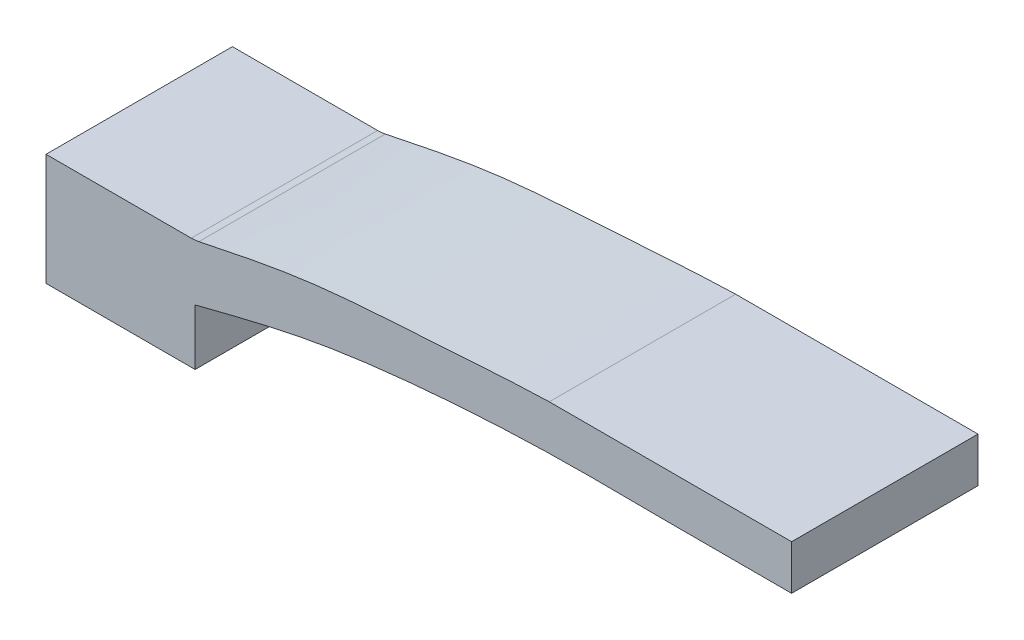
ISO-10303-21;
HEADER;
FILE_DESCRIPTION(('STEP AP214'),'2;1');
FILE_NAME('part.step','',(''),(''),'','','');
FILE_SCHEMA(('AUTOMOTIVE_DESIGN { 1 0 10303 214 1 1 1 1 }'));
ENDSEC;
DATA;
#1=APPLICATION_CONTEXT('core data for automotive mechanical design processes');
#2=APPLICATION_PROTOCOL_DEFINITION('international standard','automotive_design',2000,#1);
#3=PRODUCT_CONTEXT('',#1,'mechanical');
#4=PRODUCT('Part','Part','',(#3));
#5=PRODUCT_RELATED_PRODUCT_CATEGORY('part','',(#4));
#6=PRODUCT_DEFINITION_FORMATION('','',#4);
#7=PRODUCT_DEFINITION_CONTEXT('part definition',#1,'design');
#8=PRODUCT_DEFINITION('design','',#6,#7);
#9=PRODUCT_DEFINITION_SHAPE('','',#8);
#10=(LENGTH_UNIT() NAMED_UNIT(*) SI_UNIT(.MILLI.,.METRE.));
#11=(NAMED_UNIT(*) PLANE_ANGLE_UNIT() SI_UNIT($,.RADIAN.));
#12=(NAMED_UNIT(*) SI_UNIT($,.STERADIAN.) SOLID_ANGLE_UNIT());
#13=UNCERTAINTY_MEASURE_WITH_UNIT(LENGTH_MEASURE(1.E-05),#10,'distance_accuracy_value','');
#14=(GEOMETRIC_REPRESENTATION_CONTEXT(3) GLOBAL_UNCERTAINTY_ASSIGNED_CONTEXT((#13)) GLOBAL_UNIT_ASSIGNED_CONTEXT((#10,
#11,#12)) REPRESENTATION_CONTEXT('',''));
#15=CARTESIAN_POINT('',(0.,0.,0.));
#16=DIRECTION('',(0.,0.,1.));
#17=DIRECTION('',(1.,0.,0.));
#18=AXIS2_PLACEMENT_3D('',#15,#16,#17);
#19=CARTESIAN_POINT('',(0.,40.,0.));
#20=DIRECTION('',(1.,0.,0.));
#21=DIRECTION('',(0.,0.,-1.));
#22=AXIS2_PLACEMENT_3D('',#19,#20,#21);
#23=PLANE('',#22);
#24=DIRECTION('',(0.,0.,1.));
#25=VECTOR('',#24,1.);
#26=CARTESIAN_POINT('',(0.,30.,-50.));
#27=LINE('',#26,#25);
#28=CARTESIAN_POINT('',(0.,30.,-50.));
#29=VERTEX_POINT('',#28);
#30=CARTESIAN_POINT('',(0.,30.,0.));
#31=VERTEX_POINT('',#30);
#32=EDGE_CURVE('E133',#29,#31,#27,.T.);
#33=ORIENTED_EDGE('',*,*,#32,.F.);
#34=DIRECTION('',(0.,-1.,0.));
#35=VECTOR('',#34,1.);
#36=CARTESIAN_POINT('',(0.,40.,-50.));
#37=LINE('',#36,#35);
#38=CARTESIAN_POINT('',(0.,0.,-50.));
#39=VERTEX_POINT('',#38);
#40=EDGE_CURVE('E140',#29,#39,#37,.T.);
#41=ORIENTED_EDGE('',*,*,#40,.T.);
#42=DIRECTION('',(0.,0.,1.));
#43=VECTOR('',#42,1.);
#44=CARTESIAN_POINT('',(0.,0.,0.));
#45=LINE('',#44,#43);
#46=CARTESIAN_POINT('',(0.,0.,0.));
#47=VERTEX_POINT('',#46);
#48=EDGE_CURVE('E150',#39,#47,#45,.T.);
#49=ORIENTED_EDGE('',*,*,#48,.T.);
#50=DIRECTION('',(0.,-1.,0.));
#51=VECTOR('',#50,1.);
#52=CARTESIAN_POINT('',(0.,40.,0.));
#53=LINE('',#52,#51);
#54=EDGE_CURVE('E169',#31,#47,#53,.T.);
#55=ORIENTED_EDGE('',*,*,#54,.F.);
#56=EDGE_LOOP('',(#33,#41,#49,#55));
#57=FACE_BOUND('',#56,.T.);
#58=ADVANCED_FACE('F43',(#57),#23,.F.);
#59=CARTESIAN_POINT('',(0.,40.,0.));
#60=DIRECTION('',(0.,0.,-1.));
#61=DIRECTION('',(-1.,0.,0.));
#62=AXIS2_PLACEMENT_3D('',#59,#60,#61);
#63=PLANE('',#62);
#64=CARTESIAN_POINT('',(40.,30.,0.));
#65=CARTESIAN_POINT('',(49.9656857193114,32.0906070488281,0.));
#66=CARTESIAN_POINT('',(69.7676621871153,36.2446765981113,0.));
#67=CARTESIAN_POINT('',(101.665880924832,37.9916239881097,0.));
#68=CARTESIAN_POINT('',(134.961893861511,40.5324928061145,0.));
#69=CARTESIAN_POINT('',(158.326978774384,40.177401135886,0.));
#70=CARTESIAN_POINT('',(170.,40.,0.));
#71=B_SPLINE_CURVE_WITH_KNOTS('',3,(#64,#65,#66,#67,#68,#69,#70),.UNSPECIFIED.,.F.,.F.,(4,1,1,1,
4),(0.,0.233428342717391,0.463825839947079,0.732131409996437,1.),.UNSPECIFIED.);
#72=CARTESIAN_POINT('',(41.0147935743513,30.2128529286531,0.));
#73=VERTEX_POINT('',#72);
#74=CARTESIAN_POINT('',(135.,40.,0.));
#75=VERTEX_POINT('',#74);
#76=EDGE_CURVE('E129',#73,#75,#71,.T.);
#77=ORIENTED_EDGE('',*,*,#76,.F.);
#78=CARTESIAN_POINT('',(38.9625381799556,40.,0.));
#79=DIRECTION('',(0.,0.,-1.));
#80=DIRECTION('',(-1.,0.,0.));
#81=AXIS2_PLACEMENT_3D('',#78,#79,#80);
#82=CIRCLE('',#81,10.);
#83=CARTESIAN_POINT('',(38.9625381799556,30.,0.));
#84=VERTEX_POINT('',#83);
#85=EDGE_CURVE('E52',#73,#84,#82,.T.);
#86=ORIENTED_EDGE('',*,*,#85,.T.);
#87=DIRECTION('',(-1.,0.,0.));
#88=VECTOR('',#87,1.);
#89=CARTESIAN_POINT('',(0.,30.,0.));
#90=LINE('',#89,#88);
#91=EDGE_CURVE('E181',#84,#31,#90,.T.);
#92=ORIENTED_EDGE('',*,*,#91,.T.);
#93=ORIENTED_EDGE('',*,*,#54,.T.);
#94=DIRECTION('',(1.,0.,0.));
#95=VECTOR('',#94,1.);
#96=CARTESIAN_POINT('',(0.,0.,0.));
#97=LINE('',#96,#95);
#98=CARTESIAN_POINT('',(40.,0.,0.));
#99=VERTEX_POINT('',#98);
#100=EDGE_CURVE('E154',#47,#99,#97,.T.);
#101=ORIENTED_EDGE('',*,*,#100,.T.);
#102=DIRECTION('',(0.,-1.,0.));
#103=VECTOR('',#102,1.);
#104=CARTESIAN_POINT('',(40.,15.,0.));
#105=LINE('',#104,#103);
#106=CARTESIAN_POINT('',(40.,15.,0.));
#107=VERTEX_POINT('',#106);
#108=EDGE_CURVE('E205',#107,#99,#105,.T.);
#109=ORIENTED_EDGE('',*,*,#108,.F.);
#110=CARTESIAN_POINT('',(200.,28.,0.));
#111=CARTESIAN_POINT('',(190.000549699636,27.9716481516772,0.));
#112=CARTESIAN_POINT('',(168.335074048846,27.9102191469779,0.));
#113=CARTESIAN_POINT('',(134.972625039488,28.4302998101888,0.));
#114=CARTESIAN_POINT('',(101.569485276163,26.4846630854096,0.));
#115=CARTESIAN_POINT('',(69.6952259316316,22.6188630793739,0.));
#116=CARTESIAN_POINT('',(49.9566235564014,17.5545571461131,0.));
#117=CARTESIAN_POINT('',(40.,15.,0.));
#118=B_SPLINE_CURVE_WITH_KNOTS('',3,(#110,#111,#112,#113,#114,#115,#116,#117),.UNSPECIFIED.,.F.,
.F.,(4,1,1,1,1,4),(0.,0.186186880037556,0.403404906748039,0.620977286103071,0.808811869763734,
1.),.UNSPECIFIED.);
#119=CARTESIAN_POINT('',(200.,28.,0.));
#120=VERTEX_POINT('',#119);
#121=EDGE_CURVE('E195',#120,#107,#118,.T.);
#122=ORIENTED_EDGE('',*,*,#121,.F.);
#123=DIRECTION('',(0.,-1.,0.));
#124=VECTOR('',#123,1.);
#125=CARTESIAN_POINT('',(200.,40.,0.));
#126=LINE('',#125,#124);
#127=CARTESIAN_POINT('',(200.,40.,0.));
#128=VERTEX_POINT('',#127);
#129=EDGE_CURVE('E165',#128,#120,#126,.T.);
#130=ORIENTED_EDGE('',*,*,#129,.F.);
#131=DIRECTION('',(1.,0.,0.));
#132=VECTOR('',#131,1.);
#133=CARTESIAN_POINT('',(0.,40.,0.));
#134=LINE('',#133,#132);
#135=EDGE_CURVE('E146',#75,#128,#134,.T.);
#136=ORIENTED_EDGE('',*,*,#135,.F.);
#137=EDGE_LOOP('',(#77,#86,#92,#93,#101,#109,#122,#130,#136));
#138=FACE_BOUND('',#137,.T.);
#139=ADVANCED_FACE('F178',(#138),#63,.F.);
#140=CARTESIAN_POINT('',(0.,40.,-50.));
#141=DIRECTION('',(0.,0.,1.));
#142=DIRECTION('',(1.,0.,0.));
#143=AXIS2_PLACEMENT_3D('',#140,#141,#142);
#144=PLANE('',#143);
#145=DIRECTION('',(-1.,0.,0.));
#146=VECTOR('',#145,1.);
#147=CARTESIAN_POINT('',(0.,30.,-50.));
#148=LINE('',#147,#146);
#149=CARTESIAN_POINT('',(38.9625381799556,30.,-50.));
#150=VERTEX_POINT('',#149);
#151=EDGE_CURVE('E125',#150,#29,#148,.T.);
#152=ORIENTED_EDGE('',*,*,#151,.F.);
#153=CARTESIAN_POINT('',(38.9625381799556,40.,-50.));
#154=DIRECTION('',(0.,0.,1.));
#155=DIRECTION('',(1.,0.,0.));
#156=AXIS2_PLACEMENT_3D('',#153,#154,#155);
#157=CIRCLE('',#156,10.);
#158=CARTESIAN_POINT('',(41.0147935743513,30.2128529286531,-50.));
#159=VERTEX_POINT('',#158);
#160=EDGE_CURVE('E11',#150,#159,#157,.T.);
#161=ORIENTED_EDGE('',*,*,#160,.T.);
#162=CARTESIAN_POINT('',(40.,30.,-50.));
#163=CARTESIAN_POINT('',(49.9656857193114,32.0906070488281,-50.));
#164=CARTESIAN_POINT('',(69.7676621871153,36.2446765981113,-50.));
#165=CARTESIAN_POINT('',(101.665880924832,37.9916239881097,-50.));
#166=CARTESIAN_POINT('',(134.961893861511,40.5324928061145,-50.));
#167=CARTESIAN_POINT('',(158.326978774384,40.177401135886,-50.));
#168=CARTESIAN_POINT('',(170.,40.,-50.));
#169=B_SPLINE_CURVE_WITH_KNOTS('',3,(#162,#163,#164,#165,#166,#167,#168),.UNSPECIFIED.,.F.,.F.,
(4,1,1,1,4),(0.,0.233428342717391,0.463825839947079,0.732131409996437,1.),.UNSPECIFIED.);
#170=CARTESIAN_POINT('',(135.,40.,-50.));
#171=VERTEX_POINT('',#170);
#172=EDGE_CURVE('E113',#159,#171,#169,.T.);
#173=ORIENTED_EDGE('',*,*,#172,.T.);
#174=DIRECTION('',(-1.,0.,0.));
#175=VECTOR('',#174,1.);
#176=CARTESIAN_POINT('',(0.,40.,-50.));
#177=LINE('',#176,#175);
#178=CARTESIAN_POINT('',(200.,40.,-50.));
#179=VERTEX_POINT('',#178);
#180=EDGE_CURVE('E118',#179,#171,#177,.T.);
#181=ORIENTED_EDGE('',*,*,#180,.F.);
#182=DIRECTION('',(0.,-1.,0.));
#183=VECTOR('',#182,1.);
#184=CARTESIAN_POINT('',(200.,40.,-50.));
#185=LINE('',#184,#183);
#186=CARTESIAN_POINT('',(200.,28.,-50.));
#187=VERTEX_POINT('',#186);
#188=EDGE_CURVE('E144',#179,#187,#185,.T.);
#189=ORIENTED_EDGE('',*,*,#188,.T.);
#190=CARTESIAN_POINT('',(200.,28.,-50.));
#191=CARTESIAN_POINT('',(190.000549699636,27.9716481516772,-50.));
#192=CARTESIAN_POINT('',(168.335074048846,27.9102191469779,-50.));
#193=CARTESIAN_POINT('',(134.972625039488,28.4302998101888,-50.));
#194=CARTESIAN_POINT('',(101.569485276163,26.4846630854096,-50.));
#195=CARTESIAN_POINT('',(69.6952259316316,22.6188630793739,-50.));
#196=CARTESIAN_POINT('',(49.9566235564014,17.5545571461131,-50.));
#197=CARTESIAN_POINT('',(40.,15.,-50.));
#198=B_SPLINE_CURVE_WITH_KNOTS('',3,(#190,#191,#192,#193,#194,#195,#196,#197),.UNSPECIFIED.,.F.,
.F.,(4,1,1,1,1,4),(0.,0.186186880037556,0.403404906748039,0.620977286103071,0.808811869763734,
1.),.UNSPECIFIED.);
#199=CARTESIAN_POINT('',(40.,15.,-50.));
#200=VERTEX_POINT('',#199);
#201=EDGE_CURVE('E197',#187,#200,#198,.T.);
#202=ORIENTED_EDGE('',*,*,#201,.T.);
#203=DIRECTION('',(0.,-1.,0.));
#204=VECTOR('',#203,1.);
#205=CARTESIAN_POINT('',(40.,15.,-50.));
#206=LINE('',#205,#204);
#207=CARTESIAN_POINT('',(40.,0.,-50.));
#208=VERTEX_POINT('',#207);
#209=EDGE_CURVE('E204',#200,#208,#206,.T.);
#210=ORIENTED_EDGE('',*,*,#209,.T.);
#211=DIRECTION('',(-1.,0.,0.));
#212=VECTOR('',#211,1.);
#213=CARTESIAN_POINT('',(0.,0.,-50.));
#214=LINE('',#213,#212);
#215=EDGE_CURVE('E159',#208,#39,#214,.T.);
#216=ORIENTED_EDGE('',*,*,#215,.T.);
#217=ORIENTED_EDGE('',*,*,#40,.F.);
#218=EDGE_LOOP('',(#152,#161,#173,#181,#189,#202,#210,#216,#217));
#219=FACE_BOUND('',#218,.T.);
#220=ADVANCED_FACE('F115',(#219),#144,.F.);
#221=CARTESIAN_POINT('',(200.,40.,0.));
#222=DIRECTION('',(-1.,0.,0.));
#223=DIRECTION('',(0.,0.,1.));
#224=AXIS2_PLACEMENT_3D('',#221,#222,#223);
#225=PLANE('',#224);
#226=ORIENTED_EDGE('',*,*,#129,.T.);
#227=DIRECTION('',(0.,0.,1.));
#228=VECTOR('',#227,1.);
#229=CARTESIAN_POINT('',(200.,28.,-50.));
#230=LINE('',#229,#228);
#231=EDGE_CURVE('E155',#187,#120,#230,.T.);
#232=ORIENTED_EDGE('',*,*,#231,.F.);
#233=ORIENTED_EDGE('',*,*,#188,.F.);
#234=DIRECTION('',(0.,0.,-1.));
#235=VECTOR('',#234,1.);
#236=CARTESIAN_POINT('',(200.,40.,0.));
#237=LINE('',#236,#235);
#238=EDGE_CURVE('E137',#128,#179,#237,.T.);
#239=ORIENTED_EDGE('',*,*,#238,.F.);
#240=EDGE_LOOP('',(#226,#232,#233,#239));
#241=FACE_BOUND('',#240,.T.);
#242=ADVANCED_FACE('F221',(#241),#225,.F.);
#243=CARTESIAN_POINT('',(0.,40.,0.));
#244=DIRECTION('',(0.,-1.,0.));
#245=DIRECTION('',(0.,0.,-1.));
#246=AXIS2_PLACEMENT_3D('',#243,#244,#245);
#247=PLANE('',#246);
#248=ORIENTED_EDGE('',*,*,#180,.T.);
#249=DIRECTION('',(0.,0.,1.));
#250=VECTOR('',#249,1.);
#251=CARTESIAN_POINT('',(135.,40.,-50.));
#252=LINE('',#251,#250);
#253=EDGE_CURVE('E124',#171,#75,#252,.T.);
#254=ORIENTED_EDGE('',*,*,#253,.T.);
#255=ORIENTED_EDGE('',*,*,#135,.T.);
#256=ORIENTED_EDGE('',*,*,#238,.T.);
#257=EDGE_LOOP('',(#248,#254,#255,#256));
#258=FACE_BOUND('',#257,.T.);
#259=ADVANCED_FACE('F135',(#258),#247,.F.);
#260=CARTESIAN_POINT('',(0.,0.,0.));
#261=DIRECTION('',(0.,-1.,0.));
#262=DIRECTION('',(0.,0.,-1.));
#263=AXIS2_PLACEMENT_3D('',#260,#261,#262);
#264=PLANE('',#263);
#265=DIRECTION('',(0.,0.,1.));
#266=VECTOR('',#265,1.);
#267=CARTESIAN_POINT('',(40.,0.,-50.));
#268=LINE('',#267,#266);
#269=EDGE_CURVE('E244',#208,#99,#268,.T.);
#270=ORIENTED_EDGE('',*,*,#269,.T.);
#271=ORIENTED_EDGE('',*,*,#100,.F.);
#272=ORIENTED_EDGE('',*,*,#48,.F.);
#273=ORIENTED_EDGE('',*,*,#215,.F.);
#274=EDGE_LOOP('',(#270,#271,#272,#273));
#275=FACE_BOUND('',#274,.T.);
#276=ADVANCED_FACE('F216',(#275),#264,.T.);
#277=DIRECTION('',(0.,0.,1.));
#278=VECTOR('',#277,1.);
#279=SURFACE_OF_LINEAR_EXTRUSION('',#198,#278);
#280=ORIENTED_EDGE('',*,*,#121,.T.);
#281=DIRECTION('',(0.,0.,1.));
#282=VECTOR('',#281,1.);
#283=CARTESIAN_POINT('',(40.,15.,-50.));
#284=LINE('',#283,#282);
#285=EDGE_CURVE('E268',#200,#107,#284,.T.);
#286=ORIENTED_EDGE('',*,*,#285,.F.);
#287=ORIENTED_EDGE('',*,*,#201,.F.);
#288=ORIENTED_EDGE('',*,*,#231,.T.);
#289=EDGE_LOOP('',(#280,#286,#287,#288));
#290=FACE_BOUND('',#289,.T.);
#291=ADVANCED_FACE('F211',(#290),#279,.F.);
#292=CARTESIAN_POINT('',(40.,15.,-50.));
#293=DIRECTION('',(-1.,0.,0.));
#294=DIRECTION('',(0.,0.,1.));
#295=AXIS2_PLACEMENT_3D('',#292,#293,#294);
#296=PLANE('',#295);
#297=ORIENTED_EDGE('',*,*,#108,.T.);
#298=ORIENTED_EDGE('',*,*,#269,.F.);
#299=ORIENTED_EDGE('',*,*,#209,.F.);
#300=ORIENTED_EDGE('',*,*,#285,.T.);
#301=EDGE_LOOP('',(#297,#298,#299,#300));
#302=FACE_BOUND('',#301,.T.);
#303=ADVANCED_FACE('F215',(#302),#296,.F.);
#304=CARTESIAN_POINT('',(0.,30.,-50.));
#305=DIRECTION('',(0.,1.,0.));
#306=DIRECTION('',(-1.,0.,0.));
#307=AXIS2_PLACEMENT_3D('',#304,#305,#306);
#308=PLANE('',#307);
#309=ORIENTED_EDGE('',*,*,#91,.F.);
#310=DIRECTION('',(0.,0.,1.));
#311=VECTOR('',#310,1.);
#312=CARTESIAN_POINT('',(38.9625381799556,30.,-50.));
#313=LINE('',#312,#311);
#314=EDGE_CURVE('E59',#84,#150,#313,.F.);
#315=ORIENTED_EDGE('',*,*,#314,.T.);
#316=ORIENTED_EDGE('',*,*,#151,.T.);
#317=ORIENTED_EDGE('',*,*,#32,.T.);
#318=EDGE_LOOP('',(#309,#315,#316,#317));
#319=FACE_BOUND('',#318,.T.);
#320=ADVANCED_FACE('F247',(#319),#308,.T.);
#321=DIRECTION('',(0.,0.,1.));
#322=VECTOR('',#321,1.);
#323=SURFACE_OF_LINEAR_EXTRUSION('',#169,#322);
#324=ORIENTED_EDGE('',*,*,#172,.F.);
#325=DIRECTION('',(0.,0.,1.));
#326=VECTOR('',#325,1.);
#327=CARTESIAN_POINT('',(41.0147935743513,30.2128529286531,-50.));
#328=LINE('',#327,#326);
#329=EDGE_CURVE('E172',#159,#73,#328,.T.);
#330=ORIENTED_EDGE('',*,*,#329,.T.);
#331=ORIENTED_EDGE('',*,*,#76,.T.);
#332=ORIENTED_EDGE('',*,*,#253,.F.);
#333=EDGE_LOOP('',(#324,#330,#331,#332));
#334=FACE_BOUND('',#333,.T.);
#335=ADVANCED_FACE('F128',(#334),#323,.F.);
#336=CARTESIAN_POINT('',(38.9625381799556,40.,-25.));
#337=DIRECTION('',(0.,0.,1.));
#338=DIRECTION('',(1.,0.,0.));
#339=AXIS2_PLACEMENT_3D('',#336,#337,#338);
#340=CYLINDRICAL_SURFACE('',#339,10.);
#341=ORIENTED_EDGE('',*,*,#160,.F.);
#342=ORIENTED_EDGE('',*,*,#314,.F.);
#343=ORIENTED_EDGE('',*,*,#85,.F.);
#344=ORIENTED_EDGE('',*,*,#329,.F.);
#345=EDGE_LOOP('',(#341,#342,#343,#344));
#346=FACE_BOUND('',#345,.T.);
#347=ADVANCED_FACE('F45',(#346),#340,.F.);
#348=CLOSED_SHELL('',(#58,#139,#220,#242,#259,#276,#291,#303,#320,#335,#347));
#349=MANIFOLD_SOLID_BREP('B2',#348);
#350=ADVANCED_BREP_SHAPE_REPRESENTATION('',(#18,#349),#14);
#351=SHAPE_DEFINITION_REPRESENTATION(#9,#350);
ENDSEC;
END-ISO-10303-21;
